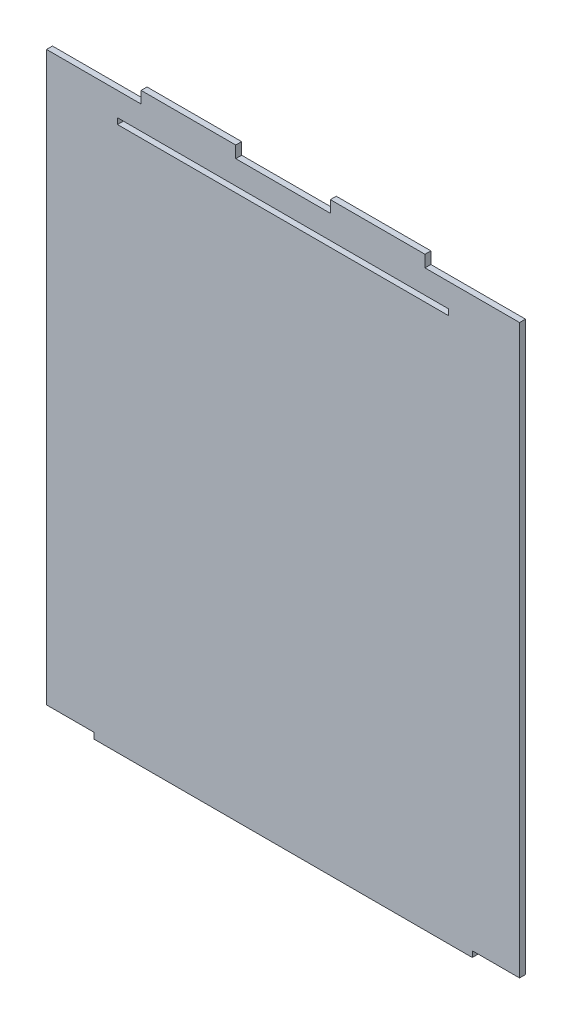
ISO-10303-21;
HEADER;
FILE_DESCRIPTION(('STEP AP214'),'2;1');
FILE_NAME('part.step','',(''),(''),'','','');
FILE_SCHEMA(('AUTOMOTIVE_DESIGN { 1 0 10303 214 1 1 1 1 }'));
ENDSEC;
DATA;
#1=APPLICATION_CONTEXT('core data for automotive mechanical design processes');
#2=APPLICATION_PROTOCOL_DEFINITION('international standard','automotive_design',2000,#1);
#3=PRODUCT_CONTEXT('',#1,'mechanical');
#4=PRODUCT('Part','Part','',(#3));
#5=PRODUCT_RELATED_PRODUCT_CATEGORY('part','',(#4));
#6=PRODUCT_DEFINITION_FORMATION('','',#4);
#7=PRODUCT_DEFINITION_CONTEXT('part definition',#1,'design');
#8=PRODUCT_DEFINITION('design','',#6,#7);
#9=PRODUCT_DEFINITION_SHAPE('','',#8);
#10=(LENGTH_UNIT() NAMED_UNIT(*) SI_UNIT(.MILLI.,.METRE.));
#11=(NAMED_UNIT(*) PLANE_ANGLE_UNIT() SI_UNIT($,.RADIAN.));
#12=(NAMED_UNIT(*) SI_UNIT($,.STERADIAN.) SOLID_ANGLE_UNIT());
#13=UNCERTAINTY_MEASURE_WITH_UNIT(LENGTH_MEASURE(1.E-05),#10,'distance_accuracy_value','');
#14=(GEOMETRIC_REPRESENTATION_CONTEXT(3) GLOBAL_UNCERTAINTY_ASSIGNED_CONTEXT((#13)) GLOBAL_UNIT_ASSIGNED_CONTEXT((#10,
#11,#12)) REPRESENTATION_CONTEXT('',''));
#15=CARTESIAN_POINT('',(0.,0.,0.));
#16=DIRECTION('',(0.,0.,1.));
#17=DIRECTION('',(1.,0.,0.));
#18=AXIS2_PLACEMENT_3D('',#15,#16,#17);
#19=CARTESIAN_POINT('',(0.,288.925,3.175));
#20=DIRECTION('',(0.,1.,0.));
#21=DIRECTION('',(-1.,0.,0.));
#22=AXIS2_PLACEMENT_3D('',#19,#20,#21);
#23=PLANE('',#22);
#24=DIRECTION('',(1.,0.,0.));
#25=VECTOR('',#24,1.);
#26=CARTESIAN_POINT('',(0.,288.925,0.));
#27=LINE('',#26,#25);
#28=CARTESIAN_POINT('',(38.1,288.925,0.));
#29=VERTEX_POINT('',#28);
#30=CARTESIAN_POINT('',(215.9,288.925,0.));
#31=VERTEX_POINT('',#30);
#32=EDGE_CURVE('E250',#29,#31,#27,.T.);
#33=ORIENTED_EDGE('',*,*,#32,.T.);
#34=DIRECTION('',(0.,0.,-1.));
#35=VECTOR('',#34,1.);
#36=CARTESIAN_POINT('',(215.9,288.925,3.175));
#37=LINE('',#36,#35);
#38=CARTESIAN_POINT('',(215.9,288.925,3.175));
#39=VERTEX_POINT('',#38);
#40=EDGE_CURVE('E11',#39,#31,#37,.T.);
#41=ORIENTED_EDGE('',*,*,#40,.F.);
#42=DIRECTION('',(1.,0.,0.));
#43=VECTOR('',#42,1.);
#44=CARTESIAN_POINT('',(0.,288.925,3.175));
#45=LINE('',#44,#43);
#46=CARTESIAN_POINT('',(38.1,288.925,3.175));
#47=VERTEX_POINT('',#46);
#48=EDGE_CURVE('E189',#47,#39,#45,.T.);
#49=ORIENTED_EDGE('',*,*,#48,.F.);
#50=DIRECTION('',(0.,0.,-1.));
#51=VECTOR('',#50,1.);
#52=CARTESIAN_POINT('',(38.1,288.925,3.175));
#53=LINE('',#52,#51);
#54=EDGE_CURVE('E56',#47,#29,#53,.T.);
#55=ORIENTED_EDGE('',*,*,#54,.T.);
#56=EDGE_LOOP('',(#33,#41,#49,#55));
#57=FACE_BOUND('',#56,.T.);
#58=ADVANCED_FACE('F37',(#57),#23,.F.);
#59=CARTESIAN_POINT('',(215.9,0.,3.175));
#60=DIRECTION('',(1.,0.,0.));
#61=DIRECTION('',(0.,0.,-1.));
#62=AXIS2_PLACEMENT_3D('',#59,#60,#61);
#63=PLANE('',#62);
#64=DIRECTION('',(0.,-1.,0.));
#65=VECTOR('',#64,1.);
#66=CARTESIAN_POINT('',(215.9,0.,0.));
#67=LINE('',#66,#65);
#68=CARTESIAN_POINT('',(215.9,285.75,0.));
#69=VERTEX_POINT('',#68);
#70=EDGE_CURVE('E195',#31,#69,#67,.T.);
#71=ORIENTED_EDGE('',*,*,#70,.T.);
#72=DIRECTION('',(0.,0.,-1.));
#73=VECTOR('',#72,1.);
#74=CARTESIAN_POINT('',(215.9,285.75,3.175));
#75=LINE('',#74,#73);
#76=CARTESIAN_POINT('',(215.9,285.75,3.175));
#77=VERTEX_POINT('',#76);
#78=EDGE_CURVE('E47',#77,#69,#75,.T.);
#79=ORIENTED_EDGE('',*,*,#78,.F.);
#80=DIRECTION('',(0.,-1.,0.));
#81=VECTOR('',#80,1.);
#82=CARTESIAN_POINT('',(215.9,0.,3.175));
#83=LINE('',#82,#81);
#84=EDGE_CURVE('E183',#39,#77,#83,.T.);
#85=ORIENTED_EDGE('',*,*,#84,.F.);
#86=ORIENTED_EDGE('',*,*,#40,.T.);
#87=EDGE_LOOP('',(#71,#79,#85,#86));
#88=FACE_BOUND('',#87,.T.);
#89=ADVANCED_FACE('F194',(#88),#63,.F.);
#90=CARTESIAN_POINT('',(0.,285.75,3.175));
#91=DIRECTION('',(0.,1.,0.));
#92=DIRECTION('',(0.,0.,1.));
#93=AXIS2_PLACEMENT_3D('',#90,#91,#92);
#94=PLANE('',#93);
#95=DIRECTION('',(1.,0.,0.));
#96=VECTOR('',#95,1.);
#97=CARTESIAN_POINT('',(0.,285.75,0.));
#98=LINE('',#97,#96);
#99=CARTESIAN_POINT('',(38.1,285.75,0.));
#100=VERTEX_POINT('',#99);
#101=EDGE_CURVE('E253',#100,#69,#98,.T.);
#102=ORIENTED_EDGE('',*,*,#101,.F.);
#103=DIRECTION('',(0.,0.,-1.));
#104=VECTOR('',#103,1.);
#105=CARTESIAN_POINT('',(38.1,285.75,3.175));
#106=LINE('',#105,#104);
#107=CARTESIAN_POINT('',(38.1,285.75,3.175));
#108=VERTEX_POINT('',#107);
#109=EDGE_CURVE('E118',#108,#100,#106,.T.);
#110=ORIENTED_EDGE('',*,*,#109,.F.);
#111=DIRECTION('',(1.,0.,0.));
#112=VECTOR('',#111,1.);
#113=CARTESIAN_POINT('',(0.,285.75,3.175));
#114=LINE('',#113,#112);
#115=EDGE_CURVE('E188',#108,#77,#114,.T.);
#116=ORIENTED_EDGE('',*,*,#115,.T.);
#117=ORIENTED_EDGE('',*,*,#78,.T.);
#118=EDGE_LOOP('',(#102,#110,#116,#117));
#119=FACE_BOUND('',#118,.T.);
#120=ADVANCED_FACE('F199',(#119),#94,.T.);
#121=CARTESIAN_POINT('',(228.6,0.,3.175));
#122=DIRECTION('',(-1.,0.,0.));
#123=DIRECTION('',(0.,0.,1.));
#124=AXIS2_PLACEMENT_3D('',#121,#122,#123);
#125=PLANE('',#124);
#126=DIRECTION('',(0.,1.,0.));
#127=VECTOR('',#126,1.);
#128=CARTESIAN_POINT('',(228.6,0.,0.));
#129=LINE('',#128,#127);
#130=CARTESIAN_POINT('',(228.6,-6.34999999999996,0.));
#131=VERTEX_POINT('',#130);
#132=CARTESIAN_POINT('',(228.6,-3.17499999999996,0.));
#133=VERTEX_POINT('',#132);
#134=EDGE_CURVE('E206',#131,#133,#129,.T.);
#135=ORIENTED_EDGE('',*,*,#134,.T.);
#136=DIRECTION('',(0.,0.,-1.));
#137=VECTOR('',#136,1.);
#138=CARTESIAN_POINT('',(228.6,-3.17499999999996,3.175));
#139=LINE('',#138,#137);
#140=CARTESIAN_POINT('',(228.6,-3.17499999999996,3.175));
#141=VERTEX_POINT('',#140);
#142=EDGE_CURVE('E41',#141,#133,#139,.T.);
#143=ORIENTED_EDGE('',*,*,#142,.F.);
#144=DIRECTION('',(0.,1.,0.));
#145=VECTOR('',#144,1.);
#146=CARTESIAN_POINT('',(228.6,0.,3.175));
#147=LINE('',#146,#145);
#148=CARTESIAN_POINT('',(228.6,-6.34999999999996,3.175));
#149=VERTEX_POINT('',#148);
#150=EDGE_CURVE('E258',#149,#141,#147,.T.);
#151=ORIENTED_EDGE('',*,*,#150,.F.);
#152=DIRECTION('',(0.,0.,-1.));
#153=VECTOR('',#152,1.);
#154=CARTESIAN_POINT('',(228.6,-6.34999999999996,3.175));
#155=LINE('',#154,#153);
#156=EDGE_CURVE('E202',#149,#131,#155,.T.);
#157=ORIENTED_EDGE('',*,*,#156,.T.);
#158=EDGE_LOOP('',(#135,#143,#151,#157));
#159=FACE_BOUND('',#158,.T.);
#160=ADVANCED_FACE('F39',(#159),#125,.F.);
#161=CARTESIAN_POINT('',(0.,-3.17499999999997,3.175));
#162=DIRECTION('',(0.,1.,0.));
#163=DIRECTION('',(-1.,0.,0.));
#164=AXIS2_PLACEMENT_3D('',#161,#162,#163);
#165=PLANE('',#164);
#166=DIRECTION('',(1.,0.,0.));
#167=VECTOR('',#166,1.);
#168=CARTESIAN_POINT('',(0.,-3.17499999999997,0.));
#169=LINE('',#168,#167);
#170=CARTESIAN_POINT('',(254.,-3.17499999999995,0.));
#171=VERTEX_POINT('',#170);
#172=EDGE_CURVE('E209',#133,#171,#169,.T.);
#173=ORIENTED_EDGE('',*,*,#172,.T.);
#174=DIRECTION('',(0.,0.,-1.));
#175=VECTOR('',#174,1.);
#176=CARTESIAN_POINT('',(254.,-3.17499999999995,3.175));
#177=LINE('',#176,#175);
#178=CARTESIAN_POINT('',(254.,-3.17499999999995,3.175));
#179=VERTEX_POINT('',#178);
#180=EDGE_CURVE('E290',#179,#171,#177,.T.);
#181=ORIENTED_EDGE('',*,*,#180,.F.);
#182=DIRECTION('',(1.,0.,0.));
#183=VECTOR('',#182,1.);
#184=CARTESIAN_POINT('',(0.,-3.17499999999997,3.175));
#185=LINE('',#184,#183);
#186=EDGE_CURVE('E131',#141,#179,#185,.T.);
#187=ORIENTED_EDGE('',*,*,#186,.F.);
#188=ORIENTED_EDGE('',*,*,#142,.T.);
#189=EDGE_LOOP('',(#173,#181,#187,#188));
#190=FACE_BOUND('',#189,.T.);
#191=ADVANCED_FACE('F296',(#190),#165,.F.);
#192=CARTESIAN_POINT('',(254.,0.,3.175));
#193=DIRECTION('',(-1.,0.,0.));
#194=DIRECTION('',(0.,0.,1.));
#195=AXIS2_PLACEMENT_3D('',#192,#193,#194);
#196=PLANE('',#195);
#197=DIRECTION('',(0.,1.,0.));
#198=VECTOR('',#197,1.);
#199=CARTESIAN_POINT('',(254.,0.,0.));
#200=LINE('',#199,#198);
#201=CARTESIAN_POINT('',(254.,301.625,0.));
#202=VERTEX_POINT('',#201);
#203=EDGE_CURVE('E211',#171,#202,#200,.T.);
#204=ORIENTED_EDGE('',*,*,#203,.T.);
#205=DIRECTION('',(0.,0.,-1.));
#206=VECTOR('',#205,1.);
#207=CARTESIAN_POINT('',(254.,301.625,3.175));
#208=LINE('',#207,#206);
#209=CARTESIAN_POINT('',(254.,301.625,3.175));
#210=VERTEX_POINT('',#209);
#211=EDGE_CURVE('E289',#210,#202,#208,.T.);
#212=ORIENTED_EDGE('',*,*,#211,.F.);
#213=DIRECTION('',(0.,1.,0.));
#214=VECTOR('',#213,1.);
#215=CARTESIAN_POINT('',(254.,0.,3.175));
#216=LINE('',#215,#214);
#217=EDGE_CURVE('E310',#179,#210,#216,.T.);
#218=ORIENTED_EDGE('',*,*,#217,.F.);
#219=ORIENTED_EDGE('',*,*,#180,.T.);
#220=EDGE_LOOP('',(#204,#212,#218,#219));
#221=FACE_BOUND('',#220,.T.);
#222=ADVANCED_FACE('F308',(#221),#196,.F.);
#223=CARTESIAN_POINT('',(0.,301.625,3.175));
#224=DIRECTION('',(0.,1.,0.));
#225=DIRECTION('',(0.,0.,1.));
#226=AXIS2_PLACEMENT_3D('',#223,#224,#225);
#227=PLANE('',#226);
#228=DIRECTION('',(1.,0.,0.));
#229=VECTOR('',#228,1.);
#230=CARTESIAN_POINT('',(0.,301.625,0.));
#231=LINE('',#230,#229);
#232=CARTESIAN_POINT('',(203.2,301.625,0.));
#233=VERTEX_POINT('',#232);
#234=EDGE_CURVE('E214',#233,#202,#231,.T.);
#235=ORIENTED_EDGE('',*,*,#234,.F.);
#236=DIRECTION('',(0.,0.,-1.));
#237=VECTOR('',#236,1.);
#238=CARTESIAN_POINT('',(203.2,301.625,3.175));
#239=LINE('',#238,#237);
#240=CARTESIAN_POINT('',(203.2,301.625,3.175));
#241=VERTEX_POINT('',#240);
#242=EDGE_CURVE('E287',#241,#233,#239,.T.);
#243=ORIENTED_EDGE('',*,*,#242,.F.);
#244=DIRECTION('',(1.,0.,0.));
#245=VECTOR('',#244,1.);
#246=CARTESIAN_POINT('',(0.,301.625,3.175));
#247=LINE('',#246,#245);
#248=EDGE_CURVE('E313',#241,#210,#247,.T.);
#249=ORIENTED_EDGE('',*,*,#248,.T.);
#250=ORIENTED_EDGE('',*,*,#211,.T.);
#251=EDGE_LOOP('',(#235,#243,#249,#250));
#252=FACE_BOUND('',#251,.T.);
#253=ADVANCED_FACE('F314',(#252),#227,.T.);
#254=CARTESIAN_POINT('',(203.2,0.,3.175));
#255=DIRECTION('',(1.,0.,0.));
#256=DIRECTION('',(0.,0.,-1.));
#257=AXIS2_PLACEMENT_3D('',#254,#255,#256);
#258=PLANE('',#257);
#259=DIRECTION('',(0.,-1.,0.));
#260=VECTOR('',#259,1.);
#261=CARTESIAN_POINT('',(203.2,0.,0.));
#262=LINE('',#261,#260);
#263=CARTESIAN_POINT('',(203.2,307.975,0.));
#264=VERTEX_POINT('',#263);
#265=EDGE_CURVE('E217',#264,#233,#262,.T.);
#266=ORIENTED_EDGE('',*,*,#265,.F.);
#267=DIRECTION('',(0.,0.,-1.));
#268=VECTOR('',#267,1.);
#269=CARTESIAN_POINT('',(203.2,307.975,3.175));
#270=LINE('',#269,#268);
#271=CARTESIAN_POINT('',(203.2,307.975,3.175));
#272=VERTEX_POINT('',#271);
#273=EDGE_CURVE('E285',#272,#264,#270,.T.);
#274=ORIENTED_EDGE('',*,*,#273,.F.);
#275=DIRECTION('',(0.,-1.,0.));
#276=VECTOR('',#275,1.);
#277=CARTESIAN_POINT('',(203.2,0.,3.175));
#278=LINE('',#277,#276);
#279=EDGE_CURVE('E318',#272,#241,#278,.T.);
#280=ORIENTED_EDGE('',*,*,#279,.T.);
#281=ORIENTED_EDGE('',*,*,#242,.T.);
#282=EDGE_LOOP('',(#266,#274,#280,#281));
#283=FACE_BOUND('',#282,.T.);
#284=ADVANCED_FACE('F399',(#283),#258,.T.);
#285=CARTESIAN_POINT('',(0.,307.975,3.175));
#286=DIRECTION('',(0.,1.,0.));
#287=DIRECTION('',(0.,0.,1.));
#288=AXIS2_PLACEMENT_3D('',#285,#286,#287);
#289=PLANE('',#288);
#290=DIRECTION('',(1.,0.,0.));
#291=VECTOR('',#290,1.);
#292=CARTESIAN_POINT('',(0.,307.975,0.));
#293=LINE('',#292,#291);
#294=CARTESIAN_POINT('',(152.4,307.975,0.));
#295=VERTEX_POINT('',#294);
#296=EDGE_CURVE('E220',#295,#264,#293,.T.);
#297=ORIENTED_EDGE('',*,*,#296,.F.);
#298=DIRECTION('',(0.,0.,-1.));
#299=VECTOR('',#298,1.);
#300=CARTESIAN_POINT('',(152.4,307.975,3.175));
#301=LINE('',#300,#299);
#302=CARTESIAN_POINT('',(152.4,307.975,3.175));
#303=VERTEX_POINT('',#302);
#304=EDGE_CURVE('E283',#303,#295,#301,.T.);
#305=ORIENTED_EDGE('',*,*,#304,.F.);
#306=DIRECTION('',(1.,0.,0.));
#307=VECTOR('',#306,1.);
#308=CARTESIAN_POINT('',(0.,307.975,3.175));
#309=LINE('',#308,#307);
#310=EDGE_CURVE('E320',#303,#272,#309,.T.);
#311=ORIENTED_EDGE('',*,*,#310,.T.);
#312=ORIENTED_EDGE('',*,*,#273,.T.);
#313=EDGE_LOOP('',(#297,#305,#311,#312));
#314=FACE_BOUND('',#313,.T.);
#315=ADVANCED_FACE('F396',(#314),#289,.T.);
#316=CARTESIAN_POINT('',(152.4,0.,3.175));
#317=DIRECTION('',(-1.,0.,0.));
#318=DIRECTION('',(0.,0.,1.));
#319=AXIS2_PLACEMENT_3D('',#316,#317,#318);
#320=PLANE('',#319);
#321=DIRECTION('',(0.,1.,0.));
#322=VECTOR('',#321,1.);
#323=CARTESIAN_POINT('',(152.4,0.,0.));
#324=LINE('',#323,#322);
#325=CARTESIAN_POINT('',(152.4,301.625,0.));
#326=VERTEX_POINT('',#325);
#327=EDGE_CURVE('E223',#326,#295,#324,.T.);
#328=ORIENTED_EDGE('',*,*,#327,.F.);
#329=DIRECTION('',(0.,0.,-1.));
#330=VECTOR('',#329,1.);
#331=CARTESIAN_POINT('',(152.4,301.625,3.175));
#332=LINE('',#331,#330);
#333=CARTESIAN_POINT('',(152.4,301.625,3.175));
#334=VERTEX_POINT('',#333);
#335=EDGE_CURVE('E281',#334,#326,#332,.T.);
#336=ORIENTED_EDGE('',*,*,#335,.F.);
#337=DIRECTION('',(0.,1.,0.));
#338=VECTOR('',#337,1.);
#339=CARTESIAN_POINT('',(152.4,0.,3.175));
#340=LINE('',#339,#338);
#341=EDGE_CURVE('E327',#334,#303,#340,.T.);
#342=ORIENTED_EDGE('',*,*,#341,.T.);
#343=ORIENTED_EDGE('',*,*,#304,.T.);
#344=EDGE_LOOP('',(#328,#336,#342,#343));
#345=FACE_BOUND('',#344,.T.);
#346=ADVANCED_FACE('F392',(#345),#320,.T.);
#347=CARTESIAN_POINT('',(0.,301.625,3.175));
#348=DIRECTION('',(0.,1.,0.));
#349=DIRECTION('',(0.,0.,1.));
#350=AXIS2_PLACEMENT_3D('',#347,#348,#349);
#351=PLANE('',#350);
#352=DIRECTION('',(1.,0.,0.));
#353=VECTOR('',#352,1.);
#354=CARTESIAN_POINT('',(0.,301.625,0.));
#355=LINE('',#354,#353);
#356=CARTESIAN_POINT('',(101.6,301.625,0.));
#357=VERTEX_POINT('',#356);
#358=EDGE_CURVE('E226',#357,#326,#355,.T.);
#359=ORIENTED_EDGE('',*,*,#358,.F.);
#360=DIRECTION('',(0.,0.,-1.));
#361=VECTOR('',#360,1.);
#362=CARTESIAN_POINT('',(101.6,301.625,3.175));
#363=LINE('',#362,#361);
#364=CARTESIAN_POINT('',(101.6,301.625,3.175));
#365=VERTEX_POINT('',#364);
#366=EDGE_CURVE('E279',#365,#357,#363,.T.);
#367=ORIENTED_EDGE('',*,*,#366,.F.);
#368=DIRECTION('',(1.,0.,0.));
#369=VECTOR('',#368,1.);
#370=CARTESIAN_POINT('',(0.,301.625,3.175));
#371=LINE('',#370,#369);
#372=EDGE_CURVE('E330',#365,#334,#371,.T.);
#373=ORIENTED_EDGE('',*,*,#372,.T.);
#374=ORIENTED_EDGE('',*,*,#335,.T.);
#375=EDGE_LOOP('',(#359,#367,#373,#374));
#376=FACE_BOUND('',#375,.T.);
#377=ADVANCED_FACE('F388',(#376),#351,.T.);
#378=CARTESIAN_POINT('',(101.600000000001,2.22044604925032E-13,3.175));
#379=DIRECTION('',(1.,0.,0.));
#380=DIRECTION('',(0.,1.,0.));
#381=AXIS2_PLACEMENT_3D('',#378,#379,#380);
#382=PLANE('',#381);
#383=DIRECTION('',(0.,-1.,0.));
#384=VECTOR('',#383,1.);
#385=CARTESIAN_POINT('',(101.600000000001,2.22044604925032E-13,0.));
#386=LINE('',#385,#384);
#387=CARTESIAN_POINT('',(101.6,307.975,0.));
#388=VERTEX_POINT('',#387);
#389=EDGE_CURVE('E229',#388,#357,#386,.T.);
#390=ORIENTED_EDGE('',*,*,#389,.F.);
#391=DIRECTION('',(0.,0.,-1.));
#392=VECTOR('',#391,1.);
#393=CARTESIAN_POINT('',(101.6,307.975,3.175));
#394=LINE('',#393,#392);
#395=CARTESIAN_POINT('',(101.6,307.975,3.175));
#396=VERTEX_POINT('',#395);
#397=EDGE_CURVE('E277',#396,#388,#394,.T.);
#398=ORIENTED_EDGE('',*,*,#397,.F.);
#399=DIRECTION('',(0.,-1.,0.));
#400=VECTOR('',#399,1.);
#401=CARTESIAN_POINT('',(101.600000000001,2.22044604925032E-13,3.175));
#402=LINE('',#401,#400);
#403=EDGE_CURVE('E333',#396,#365,#402,.T.);
#404=ORIENTED_EDGE('',*,*,#403,.T.);
#405=ORIENTED_EDGE('',*,*,#366,.T.);
#406=EDGE_LOOP('',(#390,#398,#404,#405));
#407=FACE_BOUND('',#406,.T.);
#408=ADVANCED_FACE('F384',(#407),#382,.T.);
#409=CARTESIAN_POINT('',(0.,307.975,3.175));
#410=DIRECTION('',(0.,1.,0.));
#411=DIRECTION('',(0.,0.,1.));
#412=AXIS2_PLACEMENT_3D('',#409,#410,#411);
#413=PLANE('',#412);
#414=DIRECTION('',(1.,0.,0.));
#415=VECTOR('',#414,1.);
#416=CARTESIAN_POINT('',(0.,307.975,0.));
#417=LINE('',#416,#415);
#418=CARTESIAN_POINT('',(50.8,307.975,0.));
#419=VERTEX_POINT('',#418);
#420=EDGE_CURVE('E232',#419,#388,#417,.T.);
#421=ORIENTED_EDGE('',*,*,#420,.F.);
#422=DIRECTION('',(0.,0.,-1.));
#423=VECTOR('',#422,1.);
#424=CARTESIAN_POINT('',(50.8,307.975,3.175));
#425=LINE('',#424,#423);
#426=CARTESIAN_POINT('',(50.8,307.975,3.175));
#427=VERTEX_POINT('',#426);
#428=EDGE_CURVE('E275',#427,#419,#425,.T.);
#429=ORIENTED_EDGE('',*,*,#428,.F.);
#430=DIRECTION('',(1.,0.,0.));
#431=VECTOR('',#430,1.);
#432=CARTESIAN_POINT('',(0.,307.975,3.175));
#433=LINE('',#432,#431);
#434=EDGE_CURVE('E336',#427,#396,#433,.T.);
#435=ORIENTED_EDGE('',*,*,#434,.T.);
#436=ORIENTED_EDGE('',*,*,#397,.T.);
#437=EDGE_LOOP('',(#421,#429,#435,#436));
#438=FACE_BOUND('',#437,.T.);
#439=ADVANCED_FACE('F380',(#438),#413,.T.);
#440=CARTESIAN_POINT('',(50.8,0.,3.175));
#441=DIRECTION('',(-1.,0.,0.));
#442=DIRECTION('',(0.,0.,1.));
#443=AXIS2_PLACEMENT_3D('',#440,#441,#442);
#444=PLANE('',#443);
#445=DIRECTION('',(0.,1.,0.));
#446=VECTOR('',#445,1.);
#447=CARTESIAN_POINT('',(50.8,0.,0.));
#448=LINE('',#447,#446);
#449=CARTESIAN_POINT('',(50.8,301.625,0.));
#450=VERTEX_POINT('',#449);
#451=EDGE_CURVE('E235',#450,#419,#448,.T.);
#452=ORIENTED_EDGE('',*,*,#451,.F.);
#453=DIRECTION('',(0.,0.,-1.));
#454=VECTOR('',#453,1.);
#455=CARTESIAN_POINT('',(50.8,301.625,3.175));
#456=LINE('',#455,#454);
#457=CARTESIAN_POINT('',(50.8,301.625,3.175));
#458=VERTEX_POINT('',#457);
#459=EDGE_CURVE('E273',#458,#450,#456,.T.);
#460=ORIENTED_EDGE('',*,*,#459,.F.);
#461=DIRECTION('',(0.,1.,0.));
#462=VECTOR('',#461,1.);
#463=CARTESIAN_POINT('',(50.8,0.,3.175));
#464=LINE('',#463,#462);
#465=EDGE_CURVE('E339',#458,#427,#464,.T.);
#466=ORIENTED_EDGE('',*,*,#465,.T.);
#467=ORIENTED_EDGE('',*,*,#428,.T.);
#468=EDGE_LOOP('',(#452,#460,#466,#467));
#469=FACE_BOUND('',#468,.T.);
#470=ADVANCED_FACE('F376',(#469),#444,.T.);
#471=CARTESIAN_POINT('',(0.,301.625,3.175));
#472=DIRECTION('',(0.,1.,0.));
#473=DIRECTION('',(0.,0.,1.));
#474=AXIS2_PLACEMENT_3D('',#471,#472,#473);
#475=PLANE('',#474);
#476=DIRECTION('',(1.,0.,0.));
#477=VECTOR('',#476,1.);
#478=CARTESIAN_POINT('',(0.,301.625,0.));
#479=LINE('',#478,#477);
#480=CARTESIAN_POINT('',(0.,301.625,0.));
#481=VERTEX_POINT('',#480);
#482=EDGE_CURVE('E238',#481,#450,#479,.T.);
#483=ORIENTED_EDGE('',*,*,#482,.F.);
#484=DIRECTION('',(0.,0.,-1.));
#485=VECTOR('',#484,1.);
#486=CARTESIAN_POINT('',(0.,301.625,3.175));
#487=LINE('',#486,#485);
#488=CARTESIAN_POINT('',(0.,301.625,3.175));
#489=VERTEX_POINT('',#488);
#490=EDGE_CURVE('E271',#489,#481,#487,.T.);
#491=ORIENTED_EDGE('',*,*,#490,.F.);
#492=DIRECTION('',(1.,0.,0.));
#493=VECTOR('',#492,1.);
#494=CARTESIAN_POINT('',(0.,301.625,3.175));
#495=LINE('',#494,#493);
#496=EDGE_CURVE('E342',#489,#458,#495,.T.);
#497=ORIENTED_EDGE('',*,*,#496,.T.);
#498=ORIENTED_EDGE('',*,*,#459,.T.);
#499=EDGE_LOOP('',(#483,#491,#497,#498));
#500=FACE_BOUND('',#499,.T.);
#501=ADVANCED_FACE('F372',(#500),#475,.T.);
#502=CARTESIAN_POINT('',(0.,0.,3.175));
#503=DIRECTION('',(-1.,0.,0.));
#504=DIRECTION('',(0.,-1.,0.));
#505=AXIS2_PLACEMENT_3D('',#502,#503,#504);
#506=PLANE('',#505);
#507=DIRECTION('',(0.,1.,0.));
#508=VECTOR('',#507,1.);
#509=CARTESIAN_POINT('',(0.,0.,0.));
#510=LINE('',#509,#508);
#511=CARTESIAN_POINT('',(0.,-3.17499999999997,0.));
#512=VERTEX_POINT('',#511);
#513=EDGE_CURVE('E241',#512,#481,#510,.T.);
#514=ORIENTED_EDGE('',*,*,#513,.F.);
#515=DIRECTION('',(0.,0.,-1.));
#516=VECTOR('',#515,1.);
#517=CARTESIAN_POINT('',(0.,-3.17499999999997,3.175));
#518=LINE('',#517,#516);
#519=CARTESIAN_POINT('',(0.,-3.17499999999997,3.175));
#520=VERTEX_POINT('',#519);
#521=EDGE_CURVE('E269',#520,#512,#518,.T.);
#522=ORIENTED_EDGE('',*,*,#521,.F.);
#523=DIRECTION('',(0.,1.,0.));
#524=VECTOR('',#523,1.);
#525=CARTESIAN_POINT('',(0.,0.,3.175));
#526=LINE('',#525,#524);
#527=EDGE_CURVE('E345',#520,#489,#526,.T.);
#528=ORIENTED_EDGE('',*,*,#527,.T.);
#529=ORIENTED_EDGE('',*,*,#490,.T.);
#530=EDGE_LOOP('',(#514,#522,#528,#529));
#531=FACE_BOUND('',#530,.T.);
#532=ADVANCED_FACE('F366',(#531),#506,.T.);
#533=CARTESIAN_POINT('',(0.,-3.17499999999997,3.175));
#534=DIRECTION('',(0.,1.,0.));
#535=DIRECTION('',(-1.,0.,0.));
#536=AXIS2_PLACEMENT_3D('',#533,#534,#535);
#537=PLANE('',#536);
#538=DIRECTION('',(1.,0.,0.));
#539=VECTOR('',#538,1.);
#540=CARTESIAN_POINT('',(0.,-3.17499999999997,0.));
#541=LINE('',#540,#539);
#542=CARTESIAN_POINT('',(25.4,-3.17499999999997,0.));
#543=VERTEX_POINT('',#542);
#544=EDGE_CURVE('E244',#512,#543,#541,.T.);
#545=ORIENTED_EDGE('',*,*,#544,.T.);
#546=DIRECTION('',(0.,0.,-1.));
#547=VECTOR('',#546,1.);
#548=CARTESIAN_POINT('',(25.4,-3.17499999999997,3.175));
#549=LINE('',#548,#547);
#550=CARTESIAN_POINT('',(25.4,-3.17499999999997,3.175));
#551=VERTEX_POINT('',#550);
#552=EDGE_CURVE('E266',#551,#543,#549,.T.);
#553=ORIENTED_EDGE('',*,*,#552,.F.);
#554=DIRECTION('',(1.,0.,0.));
#555=VECTOR('',#554,1.);
#556=CARTESIAN_POINT('',(0.,-3.17499999999997,3.175));
#557=LINE('',#556,#555);
#558=EDGE_CURVE('E348',#520,#551,#557,.T.);
#559=ORIENTED_EDGE('',*,*,#558,.F.);
#560=ORIENTED_EDGE('',*,*,#521,.T.);
#561=EDGE_LOOP('',(#545,#553,#559,#560));
#562=FACE_BOUND('',#561,.T.);
#563=ADVANCED_FACE('F400',(#562),#537,.F.);
#564=CARTESIAN_POINT('',(25.4,0.,3.175));
#565=DIRECTION('',(1.,0.,0.));
#566=DIRECTION('',(0.,1.,0.));
#567=AXIS2_PLACEMENT_3D('',#564,#565,#566);
#568=PLANE('',#567);
#569=DIRECTION('',(0.,-1.,0.));
#570=VECTOR('',#569,1.);
#571=CARTESIAN_POINT('',(25.4,0.,0.));
#572=LINE('',#571,#570);
#573=CARTESIAN_POINT('',(25.4,-6.34999999999997,0.));
#574=VERTEX_POINT('',#573);
#575=EDGE_CURVE('E246',#543,#574,#572,.T.);
#576=ORIENTED_EDGE('',*,*,#575,.T.);
#577=DIRECTION('',(0.,0.,-1.));
#578=VECTOR('',#577,1.);
#579=CARTESIAN_POINT('',(25.4,-6.34999999999997,3.175));
#580=LINE('',#579,#578);
#581=CARTESIAN_POINT('',(25.4,-6.34999999999997,3.175));
#582=VERTEX_POINT('',#581);
#583=EDGE_CURVE('E263',#582,#574,#580,.T.);
#584=ORIENTED_EDGE('',*,*,#583,.F.);
#585=DIRECTION('',(0.,-1.,0.));
#586=VECTOR('',#585,1.);
#587=CARTESIAN_POINT('',(25.4,0.,3.175));
#588=LINE('',#587,#586);
#589=EDGE_CURVE('E350',#551,#582,#588,.T.);
#590=ORIENTED_EDGE('',*,*,#589,.F.);
#591=ORIENTED_EDGE('',*,*,#552,.T.);
#592=EDGE_LOOP('',(#576,#584,#590,#591));
#593=FACE_BOUND('',#592,.T.);
#594=ADVANCED_FACE('F360',(#593),#568,.F.);
#595=CARTESIAN_POINT('',(0.,-6.34999999999997,3.175));
#596=DIRECTION('',(0.,1.,0.));
#597=DIRECTION('',(-1.,0.,0.));
#598=AXIS2_PLACEMENT_3D('',#595,#596,#597);
#599=PLANE('',#598);
#600=DIRECTION('',(1.,0.,0.));
#601=VECTOR('',#600,1.);
#602=CARTESIAN_POINT('',(0.,-6.34999999999997,0.));
#603=LINE('',#602,#601);
#604=EDGE_CURVE('E248',#574,#131,#603,.T.);
#605=ORIENTED_EDGE('',*,*,#604,.T.);
#606=ORIENTED_EDGE('',*,*,#156,.F.);
#607=DIRECTION('',(1.,0.,0.));
#608=VECTOR('',#607,1.);
#609=CARTESIAN_POINT('',(0.,-6.34999999999997,3.175));
#610=LINE('',#609,#608);
#611=EDGE_CURVE('E352',#582,#149,#610,.T.);
#612=ORIENTED_EDGE('',*,*,#611,.F.);
#613=ORIENTED_EDGE('',*,*,#583,.T.);
#614=EDGE_LOOP('',(#605,#606,#612,#613));
#615=FACE_BOUND('',#614,.T.);
#616=ADVANCED_FACE('F357',(#615),#599,.F.);
#617=CARTESIAN_POINT('',(38.1,0.,3.175));
#618=DIRECTION('',(1.,0.,0.));
#619=DIRECTION('',(0.,0.,-1.));
#620=AXIS2_PLACEMENT_3D('',#617,#618,#619);
#621=PLANE('',#620);
#622=DIRECTION('',(0.,-1.,0.));
#623=VECTOR('',#622,1.);
#624=CARTESIAN_POINT('',(38.1,0.,0.));
#625=LINE('',#624,#623);
#626=EDGE_CURVE('E255',#29,#100,#625,.T.);
#627=ORIENTED_EDGE('',*,*,#626,.F.);
#628=ORIENTED_EDGE('',*,*,#54,.F.);
#629=DIRECTION('',(0.,-1.,0.));
#630=VECTOR('',#629,1.);
#631=CARTESIAN_POINT('',(38.1,0.,3.175));
#632=LINE('',#631,#630);
#633=EDGE_CURVE('E200',#47,#108,#632,.T.);
#634=ORIENTED_EDGE('',*,*,#633,.T.);
#635=ORIENTED_EDGE('',*,*,#109,.T.);
#636=EDGE_LOOP('',(#627,#628,#634,#635));
#637=FACE_BOUND('',#636,.T.);
#638=ADVANCED_FACE('F418',(#637),#621,.T.);
#639=CARTESIAN_POINT('',(0.,0.,3.175));
#640=DIRECTION('',(0.,0.,1.));
#641=DIRECTION('',(1.,0.,0.));
#642=AXIS2_PLACEMENT_3D('',#639,#640,#641);
#643=PLANE('',#642);
#644=ORIENTED_EDGE('',*,*,#150,.T.);
#645=ORIENTED_EDGE('',*,*,#186,.T.);
#646=ORIENTED_EDGE('',*,*,#217,.T.);
#647=ORIENTED_EDGE('',*,*,#248,.F.);
#648=ORIENTED_EDGE('',*,*,#279,.F.);
#649=ORIENTED_EDGE('',*,*,#310,.F.);
#650=ORIENTED_EDGE('',*,*,#341,.F.);
#651=ORIENTED_EDGE('',*,*,#372,.F.);
#652=ORIENTED_EDGE('',*,*,#403,.F.);
#653=ORIENTED_EDGE('',*,*,#434,.F.);
#654=ORIENTED_EDGE('',*,*,#465,.F.);
#655=ORIENTED_EDGE('',*,*,#496,.F.);
#656=ORIENTED_EDGE('',*,*,#527,.F.);
#657=ORIENTED_EDGE('',*,*,#558,.T.);
#658=ORIENTED_EDGE('',*,*,#589,.T.);
#659=ORIENTED_EDGE('',*,*,#611,.T.);
#660=EDGE_LOOP('',(#644,#645,#646,#647,#648,#649,#650,#651,#652,#653,#654,#655,#656,#657,#658,#659));
#661=FACE_BOUND('',#660,.T.);
#662=ORIENTED_EDGE('',*,*,#48,.T.);
#663=ORIENTED_EDGE('',*,*,#84,.T.);
#664=ORIENTED_EDGE('',*,*,#115,.F.);
#665=ORIENTED_EDGE('',*,*,#633,.F.);
#666=EDGE_LOOP('',(#662,#663,#664,#665));
#667=FACE_BOUND('',#666,.T.);
#668=ADVANCED_FACE('F185',(#661,#667),#643,.T.);
#669=CARTESIAN_POINT('',(0.,0.,0.));
#670=DIRECTION('',(0.,0.,1.));
#671=DIRECTION('',(1.,0.,0.));
#672=AXIS2_PLACEMENT_3D('',#669,#670,#671);
#673=PLANE('',#672);
#674=ORIENTED_EDGE('',*,*,#134,.F.);
#675=ORIENTED_EDGE('',*,*,#604,.F.);
#676=ORIENTED_EDGE('',*,*,#575,.F.);
#677=ORIENTED_EDGE('',*,*,#544,.F.);
#678=ORIENTED_EDGE('',*,*,#513,.T.);
#679=ORIENTED_EDGE('',*,*,#482,.T.);
#680=ORIENTED_EDGE('',*,*,#451,.T.);
#681=ORIENTED_EDGE('',*,*,#420,.T.);
#682=ORIENTED_EDGE('',*,*,#389,.T.);
#683=ORIENTED_EDGE('',*,*,#358,.T.);
#684=ORIENTED_EDGE('',*,*,#327,.T.);
#685=ORIENTED_EDGE('',*,*,#296,.T.);
#686=ORIENTED_EDGE('',*,*,#265,.T.);
#687=ORIENTED_EDGE('',*,*,#234,.T.);
#688=ORIENTED_EDGE('',*,*,#203,.F.);
#689=ORIENTED_EDGE('',*,*,#172,.F.);
#690=EDGE_LOOP('',(#674,#675,#676,#677,#678,#679,#680,#681,#682,#683,#684,#685,#686,#687,#688,#689));
#691=FACE_BOUND('',#690,.T.);
#692=ORIENTED_EDGE('',*,*,#32,.F.);
#693=ORIENTED_EDGE('',*,*,#626,.T.);
#694=ORIENTED_EDGE('',*,*,#101,.T.);
#695=ORIENTED_EDGE('',*,*,#70,.F.);
#696=EDGE_LOOP('',(#692,#693,#694,#695));
#697=FACE_BOUND('',#696,.T.);
#698=ADVANCED_FACE('F303',(#691,#697),#673,.F.);
#699=CLOSED_SHELL('',(#58,#89,#120,#160,#191,#222,#253,#284,#315,#346,#377,#408,#439,#470,#501,
#532,#563,#594,#616,#638,#668,#698));
#700=MANIFOLD_SOLID_BREP('B2',#699);
#701=ADVANCED_BREP_SHAPE_REPRESENTATION('',(#18,#700),#14);
#702=SHAPE_DEFINITION_REPRESENTATION(#9,#701);
ENDSEC;
END-ISO-10303-21;
